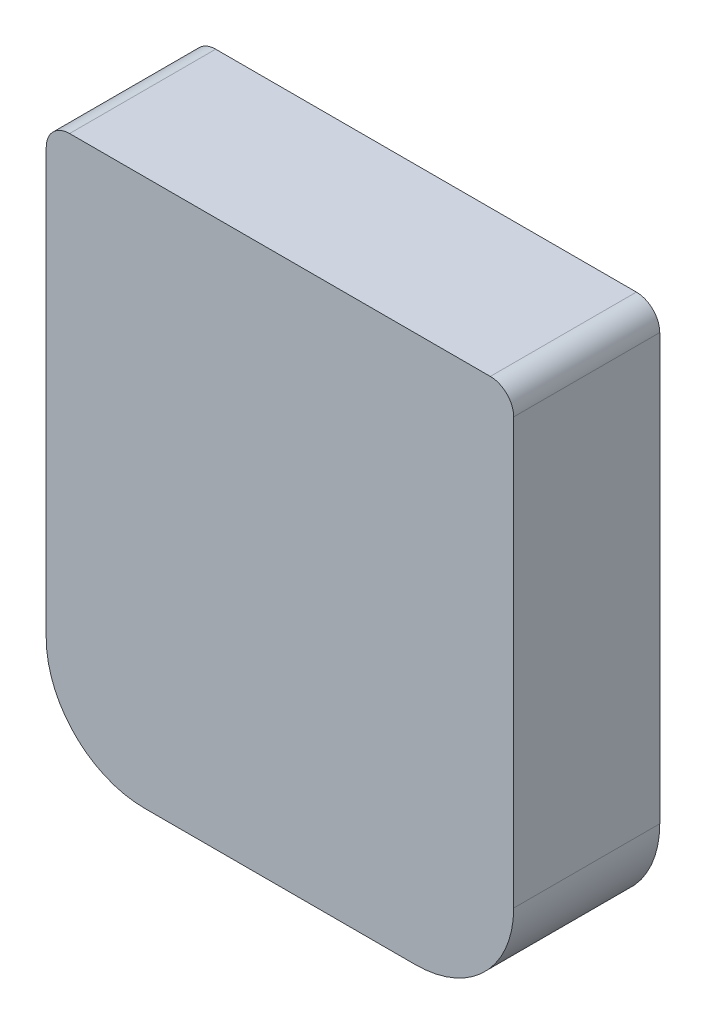
ISO-10303-21;
HEADER;
FILE_DESCRIPTION(('STEP AP214'),'2;1');
FILE_NAME('part.step','',(''),(''),'','','');
FILE_SCHEMA(('AUTOMOTIVE_DESIGN { 1 0 10303 214 1 1 1 1 }'));
ENDSEC;
DATA;
#1=APPLICATION_CONTEXT('core data for automotive mechanical design processes');
#2=APPLICATION_PROTOCOL_DEFINITION('international standard','automotive_design',2000,#1);
#3=PRODUCT_CONTEXT('',#1,'mechanical');
#4=PRODUCT('Part','Part','',(#3));
#5=PRODUCT_RELATED_PRODUCT_CATEGORY('part','',(#4));
#6=PRODUCT_DEFINITION_FORMATION('','',#4);
#7=PRODUCT_DEFINITION_CONTEXT('part definition',#1,'design');
#8=PRODUCT_DEFINITION('design','',#6,#7);
#9=PRODUCT_DEFINITION_SHAPE('','',#8);
#10=(LENGTH_UNIT() NAMED_UNIT(*) SI_UNIT(.MILLI.,.METRE.));
#11=(NAMED_UNIT(*) PLANE_ANGLE_UNIT() SI_UNIT($,.RADIAN.));
#12=(NAMED_UNIT(*) SI_UNIT($,.STERADIAN.) SOLID_ANGLE_UNIT());
#13=UNCERTAINTY_MEASURE_WITH_UNIT(LENGTH_MEASURE(1.E-05),#10,'distance_accuracy_value','');
#14=(GEOMETRIC_REPRESENTATION_CONTEXT(3) GLOBAL_UNCERTAINTY_ASSIGNED_CONTEXT((#13)) GLOBAL_UNIT_ASSIGNED_CONTEXT((#10,
#11,#12)) REPRESENTATION_CONTEXT('',''));
#15=CARTESIAN_POINT('',(0.,0.,0.));
#16=DIRECTION('',(0.,0.,1.));
#17=DIRECTION('',(1.,0.,0.));
#18=AXIS2_PLACEMENT_3D('',#15,#16,#17);
#19=CARTESIAN_POINT('',(-5.,4.9,3.125));
#20=DIRECTION('',(1.,0.,0.));
#21=DIRECTION('',(0.,1.,0.));
#22=AXIS2_PLACEMENT_3D('',#19,#20,#21);
#23=PLANE('',#22);
#24=DIRECTION('',(0.,-1.,0.));
#25=VECTOR('',#24,1.);
#26=CARTESIAN_POINT('',(-5.,4.9,3.125));
#27=LINE('',#26,#25);
#28=CARTESIAN_POINT('',(-5.,4.4,3.125));
#29=VERTEX_POINT('',#28);
#30=CARTESIAN_POINT('',(-5.,-4.7,3.125));
#31=VERTEX_POINT('',#30);
#32=EDGE_CURVE('E126',#29,#31,#27,.T.);
#33=ORIENTED_EDGE('',*,*,#32,.F.);
#34=DIRECTION('',(0.,0.,-1.));
#35=VECTOR('',#34,1.);
#36=CARTESIAN_POINT('',(-5.,4.4,3.125));
#37=LINE('',#36,#35);
#38=CARTESIAN_POINT('',(-5.,4.4,0.));
#39=VERTEX_POINT('',#38);
#40=EDGE_CURVE('E11',#29,#39,#37,.T.);
#41=ORIENTED_EDGE('',*,*,#40,.T.);
#42=DIRECTION('',(0.,-1.,0.));
#43=VECTOR('',#42,1.);
#44=CARTESIAN_POINT('',(-5.,4.9,0.));
#45=LINE('',#44,#43);
#46=CARTESIAN_POINT('',(-5.,-4.7,0.));
#47=VERTEX_POINT('',#46);
#48=EDGE_CURVE('E128',#39,#47,#45,.T.);
#49=ORIENTED_EDGE('',*,*,#48,.T.);
#50=DIRECTION('',(0.,0.,-1.));
#51=VECTOR('',#50,1.);
#52=CARTESIAN_POINT('',(-5.,-4.7,3.125));
#53=LINE('',#52,#51);
#54=EDGE_CURVE('E141',#47,#31,#53,.F.);
#55=ORIENTED_EDGE('',*,*,#54,.T.);
#56=EDGE_LOOP('',(#33,#41,#49,#55));
#57=FACE_BOUND('',#56,.T.);
#58=ADVANCED_FACE('F33',(#57),#23,.F.);
#59=CARTESIAN_POINT('',(-5.,-6.8,3.125));
#60=DIRECTION('',(0.,1.,0.));
#61=DIRECTION('',(-1.,0.,0.));
#62=AXIS2_PLACEMENT_3D('',#59,#60,#61);
#63=PLANE('',#62);
#64=DIRECTION('',(1.,0.,0.));
#65=VECTOR('',#64,1.);
#66=CARTESIAN_POINT('',(-5.,-6.8,0.));
#67=LINE('',#66,#65);
#68=CARTESIAN_POINT('',(-2.9,-6.8,0.));
#69=VERTEX_POINT('',#68);
#70=CARTESIAN_POINT('',(2.9,-6.8,0.));
#71=VERTEX_POINT('',#70);
#72=EDGE_CURVE('E123',#69,#71,#67,.T.);
#73=ORIENTED_EDGE('',*,*,#72,.T.);
#74=DIRECTION('',(0.,0.,-1.));
#75=VECTOR('',#74,1.);
#76=CARTESIAN_POINT('',(2.9,-6.8,3.125));
#77=LINE('',#76,#75);
#78=CARTESIAN_POINT('',(2.9,-6.8,3.125));
#79=VERTEX_POINT('',#78);
#80=EDGE_CURVE('E106',#71,#79,#77,.F.);
#81=ORIENTED_EDGE('',*,*,#80,.T.);
#82=DIRECTION('',(1.,0.,0.));
#83=VECTOR('',#82,1.);
#84=CARTESIAN_POINT('',(-5.,-6.8,3.125));
#85=LINE('',#84,#83);
#86=CARTESIAN_POINT('',(-2.9,-6.8,3.125));
#87=VERTEX_POINT('',#86);
#88=EDGE_CURVE('E251',#87,#79,#85,.T.);
#89=ORIENTED_EDGE('',*,*,#88,.F.);
#90=DIRECTION('',(0.,0.,-1.));
#91=VECTOR('',#90,1.);
#92=CARTESIAN_POINT('',(-2.9,-6.8,3.125));
#93=LINE('',#92,#91);
#94=EDGE_CURVE('E111',#87,#69,#93,.T.);
#95=ORIENTED_EDGE('',*,*,#94,.T.);
#96=EDGE_LOOP('',(#73,#81,#89,#95));
#97=FACE_BOUND('',#96,.T.);
#98=ADVANCED_FACE('F173',(#97),#63,.F.);
#99=CARTESIAN_POINT('',(5.,4.9,3.125));
#100=DIRECTION('',(-1.,0.,0.));
#101=DIRECTION('',(0.,-1.,0.));
#102=AXIS2_PLACEMENT_3D('',#99,#100,#101);
#103=PLANE('',#102);
#104=DIRECTION('',(0.,1.,0.));
#105=VECTOR('',#104,1.);
#106=CARTESIAN_POINT('',(5.,4.9,0.));
#107=LINE('',#106,#105);
#108=CARTESIAN_POINT('',(5.,-4.7,0.));
#109=VERTEX_POINT('',#108);
#110=CARTESIAN_POINT('',(5.,4.4,0.));
#111=VERTEX_POINT('',#110);
#112=EDGE_CURVE('E115',#109,#111,#107,.T.);
#113=ORIENTED_EDGE('',*,*,#112,.T.);
#114=DIRECTION('',(0.,0.,-1.));
#115=VECTOR('',#114,1.);
#116=CARTESIAN_POINT('',(5.,4.4,3.125));
#117=LINE('',#116,#115);
#118=CARTESIAN_POINT('',(5.,4.4,3.125));
#119=VERTEX_POINT('',#118);
#120=EDGE_CURVE('E56',#111,#119,#117,.F.);
#121=ORIENTED_EDGE('',*,*,#120,.T.);
#122=DIRECTION('',(0.,1.,0.));
#123=VECTOR('',#122,1.);
#124=CARTESIAN_POINT('',(5.,4.9,3.125));
#125=LINE('',#124,#123);
#126=CARTESIAN_POINT('',(5.,-4.7,3.125));
#127=VERTEX_POINT('',#126);
#128=EDGE_CURVE('E116',#127,#119,#125,.T.);
#129=ORIENTED_EDGE('',*,*,#128,.F.);
#130=DIRECTION('',(0.,0.,-1.));
#131=VECTOR('',#130,1.);
#132=CARTESIAN_POINT('',(5.,-4.7,3.125));
#133=LINE('',#132,#131);
#134=EDGE_CURVE('E105',#127,#109,#133,.T.);
#135=ORIENTED_EDGE('',*,*,#134,.T.);
#136=EDGE_LOOP('',(#113,#121,#129,#135));
#137=FACE_BOUND('',#136,.T.);
#138=ADVANCED_FACE('F114',(#137),#103,.F.);
#139=CARTESIAN_POINT('',(-5.,4.9,3.125));
#140=DIRECTION('',(0.,-1.,0.));
#141=DIRECTION('',(1.,0.,0.));
#142=AXIS2_PLACEMENT_3D('',#139,#140,#141);
#143=PLANE('',#142);
#144=DIRECTION('',(-1.,0.,0.));
#145=VECTOR('',#144,1.);
#146=CARTESIAN_POINT('',(-5.,4.9,3.125));
#147=LINE('',#146,#145);
#148=CARTESIAN_POINT('',(4.5,4.9,3.125));
#149=VERTEX_POINT('',#148);
#150=CARTESIAN_POINT('',(-4.5,4.9,3.125));
#151=VERTEX_POINT('',#150);
#152=EDGE_CURVE('E117',#149,#151,#147,.T.);
#153=ORIENTED_EDGE('',*,*,#152,.F.);
#154=DIRECTION('',(0.,0.,-1.));
#155=VECTOR('',#154,1.);
#156=CARTESIAN_POINT('',(4.5,4.9,3.125));
#157=LINE('',#156,#155);
#158=CARTESIAN_POINT('',(4.5,4.9,0.));
#159=VERTEX_POINT('',#158);
#160=EDGE_CURVE('E146',#149,#159,#157,.T.);
#161=ORIENTED_EDGE('',*,*,#160,.T.);
#162=DIRECTION('',(-1.,0.,0.));
#163=VECTOR('',#162,1.);
#164=CARTESIAN_POINT('',(-5.,4.9,0.));
#165=LINE('',#164,#163);
#166=CARTESIAN_POINT('',(-4.5,4.9,0.));
#167=VERTEX_POINT('',#166);
#168=EDGE_CURVE('E122',#159,#167,#165,.T.);
#169=ORIENTED_EDGE('',*,*,#168,.T.);
#170=DIRECTION('',(0.,0.,-1.));
#171=VECTOR('',#170,1.);
#172=CARTESIAN_POINT('',(-4.5,4.9,3.125));
#173=LINE('',#172,#171);
#174=EDGE_CURVE('E144',#167,#151,#173,.F.);
#175=ORIENTED_EDGE('',*,*,#174,.T.);
#176=EDGE_LOOP('',(#153,#161,#169,#175));
#177=FACE_BOUND('',#176,.T.);
#178=ADVANCED_FACE('F159',(#177),#143,.F.);
#179=CARTESIAN_POINT('',(0.,0.,3.125));
#180=DIRECTION('',(0.,0.,1.));
#181=DIRECTION('',(1.,0.,0.));
#182=AXIS2_PLACEMENT_3D('',#179,#180,#181);
#183=PLANE('',#182);
#184=ORIENTED_EDGE('',*,*,#128,.T.);
#185=CARTESIAN_POINT('',(4.5,4.4,3.125));
#186=DIRECTION('',(0.,0.,1.));
#187=DIRECTION('',(1.,0.,0.));
#188=AXIS2_PLACEMENT_3D('',#185,#186,#187);
#189=CIRCLE('',#188,0.5);
#190=EDGE_CURVE('E41',#119,#149,#189,.T.);
#191=ORIENTED_EDGE('',*,*,#190,.T.);
#192=ORIENTED_EDGE('',*,*,#152,.T.);
#193=CARTESIAN_POINT('',(-4.5,4.4,3.125));
#194=DIRECTION('',(0.,0.,1.));
#195=DIRECTION('',(1.,0.,0.));
#196=AXIS2_PLACEMENT_3D('',#193,#194,#195);
#197=CIRCLE('',#196,0.5);
#198=EDGE_CURVE('E48',#151,#29,#197,.T.);
#199=ORIENTED_EDGE('',*,*,#198,.T.);
#200=ORIENTED_EDGE('',*,*,#32,.T.);
#201=CARTESIAN_POINT('',(-2.9,-4.7,3.125));
#202=DIRECTION('',(0.,0.,1.));
#203=DIRECTION('',(1.,0.,0.));
#204=AXIS2_PLACEMENT_3D('',#201,#202,#203);
#205=CIRCLE('',#204,2.1);
#206=EDGE_CURVE('E137',#31,#87,#205,.T.);
#207=ORIENTED_EDGE('',*,*,#206,.T.);
#208=ORIENTED_EDGE('',*,*,#88,.T.);
#209=CARTESIAN_POINT('',(2.9,-4.7,3.125));
#210=DIRECTION('',(0.,0.,1.));
#211=DIRECTION('',(1.,0.,0.));
#212=AXIS2_PLACEMENT_3D('',#209,#210,#211);
#213=CIRCLE('',#212,2.1);
#214=EDGE_CURVE('E139',#79,#127,#213,.T.);
#215=ORIENTED_EDGE('',*,*,#214,.T.);
#216=EDGE_LOOP('',(#184,#191,#192,#199,#200,#207,#208,#215));
#217=FACE_BOUND('',#216,.T.);
#218=ADVANCED_FACE('F155',(#217),#183,.T.);
#219=CARTESIAN_POINT('',(0.,0.,0.));
#220=DIRECTION('',(0.,0.,1.));
#221=DIRECTION('',(1.,0.,0.));
#222=AXIS2_PLACEMENT_3D('',#219,#220,#221);
#223=PLANE('',#222);
#224=ORIENTED_EDGE('',*,*,#168,.F.);
#225=CARTESIAN_POINT('',(4.5,4.4,0.));
#226=DIRECTION('',(0.,0.,1.));
#227=DIRECTION('',(1.,0.,0.));
#228=AXIS2_PLACEMENT_3D('',#225,#226,#227);
#229=CIRCLE('',#228,0.5);
#230=EDGE_CURVE('E121',#159,#111,#229,.F.);
#231=ORIENTED_EDGE('',*,*,#230,.T.);
#232=ORIENTED_EDGE('',*,*,#112,.F.);
#233=CARTESIAN_POINT('',(2.9,-4.7,0.));
#234=DIRECTION('',(0.,0.,1.));
#235=DIRECTION('',(1.,0.,0.));
#236=AXIS2_PLACEMENT_3D('',#233,#234,#235);
#237=CIRCLE('',#236,2.1);
#238=EDGE_CURVE('E101',#109,#71,#237,.F.);
#239=ORIENTED_EDGE('',*,*,#238,.T.);
#240=ORIENTED_EDGE('',*,*,#72,.F.);
#241=CARTESIAN_POINT('',(-2.9,-4.7,0.));
#242=DIRECTION('',(0.,0.,1.));
#243=DIRECTION('',(1.,0.,0.));
#244=AXIS2_PLACEMENT_3D('',#241,#242,#243);
#245=CIRCLE('',#244,2.1);
#246=EDGE_CURVE('E112',#69,#47,#245,.F.);
#247=ORIENTED_EDGE('',*,*,#246,.T.);
#248=ORIENTED_EDGE('',*,*,#48,.F.);
#249=CARTESIAN_POINT('',(-4.5,4.4,0.));
#250=DIRECTION('',(0.,0.,1.));
#251=DIRECTION('',(1.,0.,0.));
#252=AXIS2_PLACEMENT_3D('',#249,#250,#251);
#253=CIRCLE('',#252,0.5);
#254=EDGE_CURVE('E149',#39,#167,#253,.F.);
#255=ORIENTED_EDGE('',*,*,#254,.T.);
#256=EDGE_LOOP('',(#224,#231,#232,#239,#240,#247,#248,#255));
#257=FACE_BOUND('',#256,.T.);
#258=ADVANCED_FACE('F120',(#257),#223,.F.);
#259=CARTESIAN_POINT('',(2.9,-4.7,3.125));
#260=DIRECTION('',(0.,0.,-1.));
#261=DIRECTION('',(-1.,0.,0.));
#262=AXIS2_PLACEMENT_3D('',#259,#260,#261);
#263=CYLINDRICAL_SURFACE('',#262,2.1);
#264=ORIENTED_EDGE('',*,*,#214,.F.);
#265=ORIENTED_EDGE('',*,*,#80,.F.);
#266=ORIENTED_EDGE('',*,*,#238,.F.);
#267=ORIENTED_EDGE('',*,*,#134,.F.);
#268=EDGE_LOOP('',(#264,#265,#266,#267));
#269=FACE_BOUND('',#268,.T.);
#270=ADVANCED_FACE('F104',(#269),#263,.T.);
#271=CARTESIAN_POINT('',(-2.9,-4.7,3.125));
#272=DIRECTION('',(0.,0.,-1.));
#273=DIRECTION('',(-1.,0.,0.));
#274=AXIS2_PLACEMENT_3D('',#271,#272,#273);
#275=CYLINDRICAL_SURFACE('',#274,2.1);
#276=ORIENTED_EDGE('',*,*,#206,.F.);
#277=ORIENTED_EDGE('',*,*,#54,.F.);
#278=ORIENTED_EDGE('',*,*,#246,.F.);
#279=ORIENTED_EDGE('',*,*,#94,.F.);
#280=EDGE_LOOP('',(#276,#277,#278,#279));
#281=FACE_BOUND('',#280,.T.);
#282=ADVANCED_FACE('F164',(#281),#275,.T.);
#283=CARTESIAN_POINT('',(4.5,4.4,3.125));
#284=DIRECTION('',(0.,0.,-1.));
#285=DIRECTION('',(-1.,0.,0.));
#286=AXIS2_PLACEMENT_3D('',#283,#284,#285);
#287=CYLINDRICAL_SURFACE('',#286,0.5);
#288=ORIENTED_EDGE('',*,*,#190,.F.);
#289=ORIENTED_EDGE('',*,*,#120,.F.);
#290=ORIENTED_EDGE('',*,*,#230,.F.);
#291=ORIENTED_EDGE('',*,*,#160,.F.);
#292=EDGE_LOOP('',(#288,#289,#290,#291));
#293=FACE_BOUND('',#292,.T.);
#294=ADVANCED_FACE('F162',(#293),#287,.T.);
#295=CARTESIAN_POINT('',(-4.5,4.4,3.125));
#296=DIRECTION('',(0.,0.,-1.));
#297=DIRECTION('',(-1.,0.,0.));
#298=AXIS2_PLACEMENT_3D('',#295,#296,#297);
#299=CYLINDRICAL_SURFACE('',#298,0.5);
#300=ORIENTED_EDGE('',*,*,#198,.F.);
#301=ORIENTED_EDGE('',*,*,#174,.F.);
#302=ORIENTED_EDGE('',*,*,#254,.F.);
#303=ORIENTED_EDGE('',*,*,#40,.F.);
#304=EDGE_LOOP('',(#300,#301,#302,#303));
#305=FACE_BOUND('',#304,.T.);
#306=ADVANCED_FACE('F35',(#305),#299,.T.);
#307=CLOSED_SHELL('',(#58,#98,#138,#178,#218,#258,#270,#282,#294,#306));
#308=MANIFOLD_SOLID_BREP('B2',#307);
#309=ADVANCED_BREP_SHAPE_REPRESENTATION('',(#18,#308),#14);
#310=SHAPE_DEFINITION_REPRESENTATION(#9,#309);
ENDSEC;
END-ISO-10303-21;
